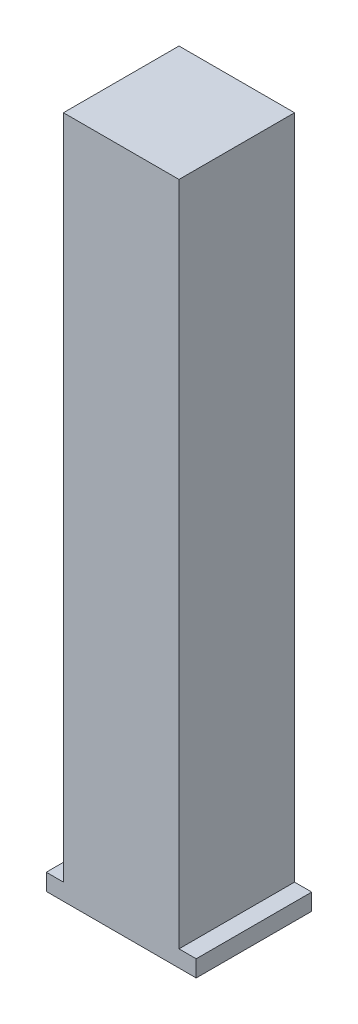
ISO-10303-21;
HEADER;
FILE_DESCRIPTION(('STEP AP214'),'2;1');
FILE_NAME('part.step','',(''),(''),'','','');
FILE_SCHEMA(('AUTOMOTIVE_DESIGN { 1 0 10303 214 1 1 1 1 }'));
ENDSEC;
DATA;
#1=APPLICATION_CONTEXT('core data for automotive mechanical design processes');
#2=APPLICATION_PROTOCOL_DEFINITION('international standard','automotive_design',2000,#1);
#3=PRODUCT_CONTEXT('',#1,'mechanical');
#4=PRODUCT('Part','Part','',(#3));
#5=PRODUCT_RELATED_PRODUCT_CATEGORY('part','',(#4));
#6=PRODUCT_DEFINITION_FORMATION('','',#4);
#7=PRODUCT_DEFINITION_CONTEXT('part definition',#1,'design');
#8=PRODUCT_DEFINITION('design','',#6,#7);
#9=PRODUCT_DEFINITION_SHAPE('','',#8);
#10=(LENGTH_UNIT() NAMED_UNIT(*) SI_UNIT(.MILLI.,.METRE.));
#11=(NAMED_UNIT(*) PLANE_ANGLE_UNIT() SI_UNIT($,.RADIAN.));
#12=(NAMED_UNIT(*) SI_UNIT($,.STERADIAN.) SOLID_ANGLE_UNIT());
#13=UNCERTAINTY_MEASURE_WITH_UNIT(LENGTH_MEASURE(1.E-05),#10,'distance_accuracy_value','');
#14=(GEOMETRIC_REPRESENTATION_CONTEXT(3) GLOBAL_UNCERTAINTY_ASSIGNED_CONTEXT((#13)) GLOBAL_UNIT_ASSIGNED_CONTEXT((#10,
#11,#12)) REPRESENTATION_CONTEXT('',''));
#15=CARTESIAN_POINT('',(0.,0.,0.));
#16=DIRECTION('',(0.,0.,1.));
#17=DIRECTION('',(1.,0.,0.));
#18=AXIS2_PLACEMENT_3D('',#15,#16,#17);
#19=CARTESIAN_POINT('',(0.,3.175,0.));
#20=DIRECTION('',(0.,1.,0.));
#21=DIRECTION('',(0.,0.,1.));
#22=AXIS2_PLACEMENT_3D('',#19,#20,#21);
#23=PLANE('',#22);
#24=DIRECTION('',(0.,0.,-1.));
#25=VECTOR('',#24,1.);
#26=CARTESIAN_POINT('',(11.012499946,3.175,-11.012499946));
#27=LINE('',#26,#25);
#28=CARTESIAN_POINT('',(11.012499946,3.175,11.012499946));
#29=VERTEX_POINT('',#28);
#30=CARTESIAN_POINT('',(11.012499946,3.175,-11.012499946));
#31=VERTEX_POINT('',#30);
#32=EDGE_CURVE('E55',#29,#31,#27,.T.);
#33=ORIENTED_EDGE('',*,*,#32,.F.);
#34=DIRECTION('',(1.,0.,0.));
#35=VECTOR('',#34,1.);
#36=CARTESIAN_POINT('',(-14.2875,3.175,11.012499946));
#37=LINE('',#36,#35);
#38=CARTESIAN_POINT('',(14.2875,3.175,11.012499946));
#39=VERTEX_POINT('',#38);
#40=EDGE_CURVE('E152',#29,#39,#37,.T.);
#41=ORIENTED_EDGE('',*,*,#40,.T.);
#42=DIRECTION('',(0.,0.,-1.));
#43=VECTOR('',#42,1.);
#44=CARTESIAN_POINT('',(14.2875,3.175,-11.012499946));
#45=LINE('',#44,#43);
#46=CARTESIAN_POINT('',(14.2875,3.175,-11.012499946));
#47=VERTEX_POINT('',#46);
#48=EDGE_CURVE('E140',#39,#47,#45,.T.);
#49=ORIENTED_EDGE('',*,*,#48,.T.);
#50=DIRECTION('',(-1.,0.,0.));
#51=VECTOR('',#50,1.);
#52=CARTESIAN_POINT('',(-14.2875,3.175,-11.012499946));
#53=LINE('',#52,#51);
#54=EDGE_CURVE('E146',#47,#31,#53,.T.);
#55=ORIENTED_EDGE('',*,*,#54,.T.);
#56=EDGE_LOOP('',(#33,#41,#49,#55));
#57=FACE_BOUND('',#56,.T.);
#58=ADVANCED_FACE('F39',(#57),#23,.T.);
#59=CARTESIAN_POINT('',(14.2875,3.175,-11.012499946));
#60=DIRECTION('',(-1.,0.,0.));
#61=DIRECTION('',(0.,0.,1.));
#62=AXIS2_PLACEMENT_3D('',#59,#60,#61);
#63=PLANE('',#62);
#64=DIRECTION('',(0.,0.,-1.));
#65=VECTOR('',#64,1.);
#66=CARTESIAN_POINT('',(14.2875,0.,-11.012499946));
#67=LINE('',#66,#65);
#68=CARTESIAN_POINT('',(14.2875,0.,11.012499946));
#69=VERTEX_POINT('',#68);
#70=CARTESIAN_POINT('',(14.2875,0.,-11.012499946));
#71=VERTEX_POINT('',#70);
#72=EDGE_CURVE('E129',#69,#71,#67,.T.);
#73=ORIENTED_EDGE('',*,*,#72,.T.);
#74=DIRECTION('',(0.,-1.,0.));
#75=VECTOR('',#74,1.);
#76=CARTESIAN_POINT('',(14.2875,3.175,-11.012499946));
#77=LINE('',#76,#75);
#78=EDGE_CURVE('E11',#47,#71,#77,.T.);
#79=ORIENTED_EDGE('',*,*,#78,.F.);
#80=ORIENTED_EDGE('',*,*,#48,.F.);
#81=DIRECTION('',(0.,-1.,0.));
#82=VECTOR('',#81,1.);
#83=CARTESIAN_POINT('',(14.2875,3.175,11.012499946));
#84=LINE('',#83,#82);
#85=EDGE_CURVE('E155',#39,#69,#84,.T.);
#86=ORIENTED_EDGE('',*,*,#85,.T.);
#87=EDGE_LOOP('',(#73,#79,#80,#86));
#88=FACE_BOUND('',#87,.T.);
#89=ADVANCED_FACE('F41',(#88),#63,.F.);
#90=CARTESIAN_POINT('',(-14.2875,3.175,-11.012499946));
#91=DIRECTION('',(0.,0.,1.));
#92=DIRECTION('',(1.,0.,0.));
#93=AXIS2_PLACEMENT_3D('',#90,#91,#92);
#94=PLANE('',#93);
#95=DIRECTION('',(-1.,0.,0.));
#96=VECTOR('',#95,1.);
#97=CARTESIAN_POINT('',(-14.2875,0.,-11.012499946));
#98=LINE('',#97,#96);
#99=CARTESIAN_POINT('',(-14.2875,0.,-11.012499946));
#100=VERTEX_POINT('',#99);
#101=EDGE_CURVE('E134',#71,#100,#98,.T.);
#102=ORIENTED_EDGE('',*,*,#101,.T.);
#103=DIRECTION('',(0.,-1.,0.));
#104=VECTOR('',#103,1.);
#105=CARTESIAN_POINT('',(-14.2875,3.175,-11.012499946));
#106=LINE('',#105,#104);
#107=CARTESIAN_POINT('',(-14.2875,3.175,-11.012499946));
#108=VERTEX_POINT('',#107);
#109=EDGE_CURVE('E48',#108,#100,#106,.T.);
#110=ORIENTED_EDGE('',*,*,#109,.F.);
#111=CARTESIAN_POINT('',(-11.012499946,3.175,-11.012499946));
#112=VERTEX_POINT('',#111);
#113=EDGE_CURVE('E144',#112,#108,#53,.T.);
#114=ORIENTED_EDGE('',*,*,#113,.F.);
#115=DIRECTION('',(0.,-1.,0.));
#116=VECTOR('',#115,1.);
#117=CARTESIAN_POINT('',(-11.012499946,130.175,-11.012499946));
#118=LINE('',#117,#116);
#119=CARTESIAN_POINT('',(-11.012499946,130.175,-11.012499946));
#120=VERTEX_POINT('',#119);
#121=EDGE_CURVE('E111',#120,#112,#118,.T.);
#122=ORIENTED_EDGE('',*,*,#121,.F.);
#123=DIRECTION('',(-1.,0.,0.));
#124=VECTOR('',#123,1.);
#125=CARTESIAN_POINT('',(-11.012499946,130.175,-11.012499946));
#126=LINE('',#125,#124);
#127=CARTESIAN_POINT('',(11.012499946,130.175,-11.012499946));
#128=VERTEX_POINT('',#127);
#129=EDGE_CURVE('E105',#128,#120,#126,.T.);
#130=ORIENTED_EDGE('',*,*,#129,.F.);
#131=DIRECTION('',(0.,-1.,0.));
#132=VECTOR('',#131,1.);
#133=CARTESIAN_POINT('',(11.012499946,130.175,-11.012499946));
#134=LINE('',#133,#132);
#135=EDGE_CURVE('E109',#128,#31,#134,.T.);
#136=ORIENTED_EDGE('',*,*,#135,.T.);
#137=ORIENTED_EDGE('',*,*,#54,.F.);
#138=ORIENTED_EDGE('',*,*,#78,.T.);
#139=EDGE_LOOP('',(#102,#110,#114,#122,#130,#136,#137,#138));
#140=FACE_BOUND('',#139,.T.);
#141=ADVANCED_FACE('F107',(#140),#94,.F.);
#142=CARTESIAN_POINT('',(-14.2875,3.175,-11.012499946));
#143=DIRECTION('',(1.,0.,0.));
#144=DIRECTION('',(0.,0.,-1.));
#145=AXIS2_PLACEMENT_3D('',#142,#143,#144);
#146=PLANE('',#145);
#147=DIRECTION('',(0.,0.,1.));
#148=VECTOR('',#147,1.);
#149=CARTESIAN_POINT('',(-14.2875,0.,-11.012499946));
#150=LINE('',#149,#148);
#151=CARTESIAN_POINT('',(-14.2875,0.,11.012499946));
#152=VERTEX_POINT('',#151);
#153=EDGE_CURVE('E159',#100,#152,#150,.T.);
#154=ORIENTED_EDGE('',*,*,#153,.T.);
#155=DIRECTION('',(0.,-1.,0.));
#156=VECTOR('',#155,1.);
#157=CARTESIAN_POINT('',(-14.2875,3.175,11.012499946));
#158=LINE('',#157,#156);
#159=CARTESIAN_POINT('',(-14.2875,3.175,11.012499946));
#160=VERTEX_POINT('',#159);
#161=EDGE_CURVE('E167',#160,#152,#158,.T.);
#162=ORIENTED_EDGE('',*,*,#161,.F.);
#163=DIRECTION('',(0.,0.,1.));
#164=VECTOR('',#163,1.);
#165=CARTESIAN_POINT('',(-14.2875,3.175,-11.012499946));
#166=LINE('',#165,#164);
#167=EDGE_CURVE('E149',#108,#160,#166,.T.);
#168=ORIENTED_EDGE('',*,*,#167,.F.);
#169=ORIENTED_EDGE('',*,*,#109,.T.);
#170=EDGE_LOOP('',(#154,#162,#168,#169));
#171=FACE_BOUND('',#170,.T.);
#172=ADVANCED_FACE('F176',(#171),#146,.F.);
#173=CARTESIAN_POINT('',(-14.2875,3.175,11.012499946));
#174=DIRECTION('',(0.,0.,-1.));
#175=DIRECTION('',(-1.,0.,0.));
#176=AXIS2_PLACEMENT_3D('',#173,#174,#175);
#177=PLANE('',#176);
#178=DIRECTION('',(1.,0.,0.));
#179=VECTOR('',#178,1.);
#180=CARTESIAN_POINT('',(-14.2875,0.,11.012499946));
#181=LINE('',#180,#179);
#182=EDGE_CURVE('E145',#152,#69,#181,.T.);
#183=ORIENTED_EDGE('',*,*,#182,.T.);
#184=ORIENTED_EDGE('',*,*,#85,.F.);
#185=ORIENTED_EDGE('',*,*,#40,.F.);
#186=DIRECTION('',(0.,-1.,0.));
#187=VECTOR('',#186,1.);
#188=CARTESIAN_POINT('',(11.012499946,130.175,11.012499946));
#189=LINE('',#188,#187);
#190=CARTESIAN_POINT('',(11.012499946,130.175,11.012499946));
#191=VERTEX_POINT('',#190);
#192=EDGE_CURVE('E199',#191,#29,#189,.T.);
#193=ORIENTED_EDGE('',*,*,#192,.F.);
#194=DIRECTION('',(1.,0.,0.));
#195=VECTOR('',#194,1.);
#196=CARTESIAN_POINT('',(-11.012499946,130.175,11.012499946));
#197=LINE('',#196,#195);
#198=CARTESIAN_POINT('',(-11.012499946,130.175,11.012499946));
#199=VERTEX_POINT('',#198);
#200=EDGE_CURVE('E121',#199,#191,#197,.T.);
#201=ORIENTED_EDGE('',*,*,#200,.F.);
#202=DIRECTION('',(0.,-1.,0.));
#203=VECTOR('',#202,1.);
#204=CARTESIAN_POINT('',(-11.012499946,130.175,11.012499946));
#205=LINE('',#204,#203);
#206=CARTESIAN_POINT('',(-11.012499946,3.175,11.012499946));
#207=VERTEX_POINT('',#206);
#208=EDGE_CURVE('E136',#199,#207,#205,.T.);
#209=ORIENTED_EDGE('',*,*,#208,.T.);
#210=EDGE_CURVE('E153',#160,#207,#37,.T.);
#211=ORIENTED_EDGE('',*,*,#210,.F.);
#212=ORIENTED_EDGE('',*,*,#161,.T.);
#213=EDGE_LOOP('',(#183,#184,#185,#193,#201,#209,#211,#212));
#214=FACE_BOUND('',#213,.T.);
#215=ADVANCED_FACE('F184',(#214),#177,.F.);
#216=DIRECTION('',(0.,0.,1.));
#217=VECTOR('',#216,1.);
#218=CARTESIAN_POINT('',(-11.012499946,3.175,-11.012499946));
#219=LINE('',#218,#217);
#220=EDGE_CURVE('E63',#112,#207,#219,.T.);
#221=ORIENTED_EDGE('',*,*,#220,.F.);
#222=ORIENTED_EDGE('',*,*,#113,.T.);
#223=ORIENTED_EDGE('',*,*,#167,.T.);
#224=ORIENTED_EDGE('',*,*,#210,.T.);
#225=EDGE_LOOP('',(#221,#222,#223,#224));
#226=FACE_BOUND('',#225,.T.);
#227=ADVANCED_FACE('F191',(#226),#23,.T.);
#228=CARTESIAN_POINT('',(0.,0.,0.));
#229=DIRECTION('',(0.,1.,0.));
#230=DIRECTION('',(0.,0.,1.));
#231=AXIS2_PLACEMENT_3D('',#228,#229,#230);
#232=PLANE('',#231);
#233=ORIENTED_EDGE('',*,*,#72,.F.);
#234=ORIENTED_EDGE('',*,*,#182,.F.);
#235=ORIENTED_EDGE('',*,*,#153,.F.);
#236=ORIENTED_EDGE('',*,*,#101,.F.);
#237=EDGE_LOOP('',(#233,#234,#235,#236));
#238=FACE_BOUND('',#237,.T.);
#239=ADVANCED_FACE('F181',(#238),#232,.F.);
#240=CARTESIAN_POINT('',(11.012499946,130.175,-11.012499946));
#241=DIRECTION('',(-1.,0.,0.));
#242=DIRECTION('',(0.,0.,1.));
#243=AXIS2_PLACEMENT_3D('',#240,#241,#242);
#244=PLANE('',#243);
#245=ORIENTED_EDGE('',*,*,#32,.T.);
#246=ORIENTED_EDGE('',*,*,#135,.F.);
#247=DIRECTION('',(0.,0.,-1.));
#248=VECTOR('',#247,1.);
#249=CARTESIAN_POINT('',(11.012499946,130.175,-11.012499946));
#250=LINE('',#249,#248);
#251=EDGE_CURVE('E116',#191,#128,#250,.T.);
#252=ORIENTED_EDGE('',*,*,#251,.F.);
#253=ORIENTED_EDGE('',*,*,#192,.T.);
#254=EDGE_LOOP('',(#245,#246,#252,#253));
#255=FACE_BOUND('',#254,.T.);
#256=ADVANCED_FACE('F127',(#255),#244,.F.);
#257=CARTESIAN_POINT('',(-11.012499946,130.175,-11.012499946));
#258=DIRECTION('',(1.,0.,0.));
#259=DIRECTION('',(0.,0.,-1.));
#260=AXIS2_PLACEMENT_3D('',#257,#258,#259);
#261=PLANE('',#260);
#262=ORIENTED_EDGE('',*,*,#220,.T.);
#263=ORIENTED_EDGE('',*,*,#208,.F.);
#264=DIRECTION('',(0.,0.,1.));
#265=VECTOR('',#264,1.);
#266=CARTESIAN_POINT('',(-11.012499946,130.175,-11.012499946));
#267=LINE('',#266,#265);
#268=EDGE_CURVE('E115',#120,#199,#267,.T.);
#269=ORIENTED_EDGE('',*,*,#268,.F.);
#270=ORIENTED_EDGE('',*,*,#121,.T.);
#271=EDGE_LOOP('',(#262,#263,#269,#270));
#272=FACE_BOUND('',#271,.T.);
#273=ADVANCED_FACE('F193',(#272),#261,.F.);
#274=CARTESIAN_POINT('',(0.,130.175,0.));
#275=DIRECTION('',(0.,1.,0.));
#276=DIRECTION('',(0.,0.,1.));
#277=AXIS2_PLACEMENT_3D('',#274,#275,#276);
#278=PLANE('',#277);
#279=ORIENTED_EDGE('',*,*,#251,.T.);
#280=ORIENTED_EDGE('',*,*,#129,.T.);
#281=ORIENTED_EDGE('',*,*,#268,.T.);
#282=ORIENTED_EDGE('',*,*,#200,.T.);
#283=EDGE_LOOP('',(#279,#280,#281,#282));
#284=FACE_BOUND('',#283,.T.);
#285=ADVANCED_FACE('F119',(#284),#278,.T.);
#286=CLOSED_SHELL('',(#58,#89,#141,#172,#215,#227,#239,#256,#273,#285));
#287=MANIFOLD_SOLID_BREP('B2',#286);
#288=ADVANCED_BREP_SHAPE_REPRESENTATION('',(#18,#287),#14);
#289=SHAPE_DEFINITION_REPRESENTATION(#9,#288);
ENDSEC;
END-ISO-10303-21;
